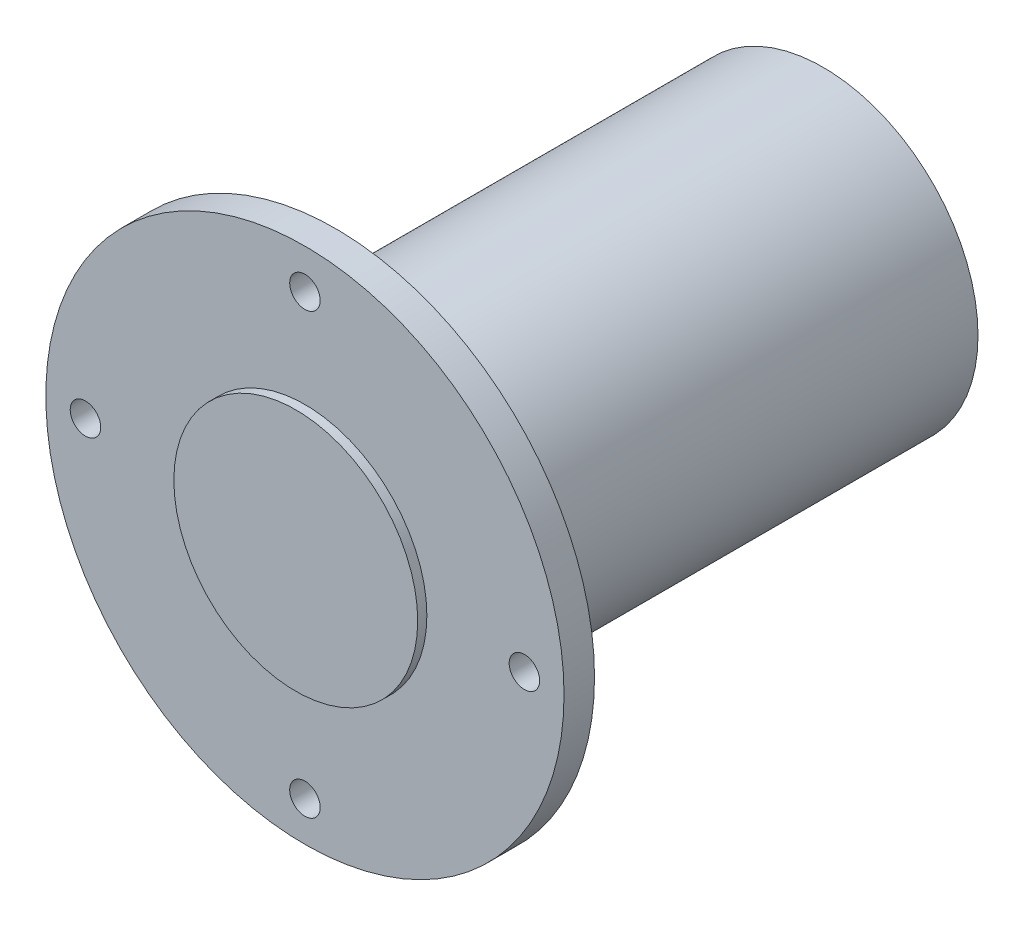
ISO-10303-21;
HEADER;
FILE_DESCRIPTION(('STEP AP214'),'2;1');
FILE_NAME('part.step','',(''),(''),'','','');
FILE_SCHEMA(('AUTOMOTIVE_DESIGN { 1 0 10303 214 1 1 1 1 }'));
ENDSEC;
DATA;
#1=APPLICATION_CONTEXT('core data for automotive mechanical design processes');
#2=APPLICATION_PROTOCOL_DEFINITION('international standard','automotive_design',2000,#1);
#3=PRODUCT_CONTEXT('',#1,'mechanical');
#4=PRODUCT('Part','Part','',(#3));
#5=PRODUCT_RELATED_PRODUCT_CATEGORY('part','',(#4));
#6=PRODUCT_DEFINITION_FORMATION('','',#4);
#7=PRODUCT_DEFINITION_CONTEXT('part definition',#1,'design');
#8=PRODUCT_DEFINITION('design','',#6,#7);
#9=PRODUCT_DEFINITION_SHAPE('','',#8);
#10=(LENGTH_UNIT() NAMED_UNIT(*) SI_UNIT(.MILLI.,.METRE.));
#11=(NAMED_UNIT(*) PLANE_ANGLE_UNIT() SI_UNIT($,.RADIAN.));
#12=(NAMED_UNIT(*) SI_UNIT($,.STERADIAN.) SOLID_ANGLE_UNIT());
#13=UNCERTAINTY_MEASURE_WITH_UNIT(LENGTH_MEASURE(1.E-05),#10,'distance_accuracy_value','');
#14=(GEOMETRIC_REPRESENTATION_CONTEXT(3) GLOBAL_UNCERTAINTY_ASSIGNED_CONTEXT((#13)) GLOBAL_UNIT_ASSIGNED_CONTEXT((#10,
#11,#12)) REPRESENTATION_CONTEXT('',''));
#15=CARTESIAN_POINT('',(0.,0.,0.));
#16=DIRECTION('',(0.,0.,1.));
#17=DIRECTION('',(1.,0.,0.));
#18=AXIS2_PLACEMENT_3D('',#15,#16,#17);
#19=CARTESIAN_POINT('',(0.,0.,0.));
#20=DIRECTION('',(0.,0.,1.));
#21=DIRECTION('',(1.,0.,0.));
#22=AXIS2_PLACEMENT_3D('',#19,#20,#21);
#23=PLANE('',#22);
#24=CARTESIAN_POINT('',(0.,36.,0.));
#25=DIRECTION('',(0.,0.,-1.));
#26=DIRECTION('',(-1.,0.,0.));
#27=AXIS2_PLACEMENT_3D('',#24,#25,#26);
#28=CIRCLE('',#27,2.49999999999999);
#29=CARTESIAN_POINT('',(-2.49999999999999,36.,0.));
#30=VERTEX_POINT('',#29);
#31=EDGE_CURVE('E105',#30,#30,#28,.T.);
#32=ORIENTED_EDGE('',*,*,#31,.F.);
#33=EDGE_LOOP('',(#32));
#34=FACE_BOUND('',#33,.T.);
#35=CARTESIAN_POINT('',(36.,0.,0.));
#36=DIRECTION('',(0.,0.,-1.));
#37=DIRECTION('',(-1.,0.,0.));
#38=AXIS2_PLACEMENT_3D('',#35,#36,#37);
#39=CIRCLE('',#38,2.49999999999999);
#40=CARTESIAN_POINT('',(33.5,0.,0.));
#41=VERTEX_POINT('',#40);
#42=EDGE_CURVE('E81',#41,#41,#39,.T.);
#43=ORIENTED_EDGE('',*,*,#42,.F.);
#44=EDGE_LOOP('',(#43));
#45=FACE_BOUND('',#44,.T.);
#46=CARTESIAN_POINT('',(0.,0.,0.));
#47=DIRECTION('',(0.,0.,1.));
#48=DIRECTION('',(1.,0.,0.));
#49=AXIS2_PLACEMENT_3D('',#46,#47,#48);
#50=CIRCLE('',#49,30.4);
#51=CARTESIAN_POINT('',(30.4,0.,0.));
#52=VERTEX_POINT('',#51);
#53=EDGE_CURVE('E10',#52,#52,#50,.T.);
#54=ORIENTED_EDGE('',*,*,#53,.T.);
#55=EDGE_LOOP('',(#54));
#56=FACE_BOUND('',#55,.T.);
#57=CARTESIAN_POINT('',(0.,0.,0.));
#58=DIRECTION('',(0.,0.,1.));
#59=DIRECTION('',(1.,0.,0.));
#60=AXIS2_PLACEMENT_3D('',#57,#58,#59);
#61=CIRCLE('',#60,42.5);
#62=CARTESIAN_POINT('',(42.5,0.,0.));
#63=VERTEX_POINT('',#62);
#64=EDGE_CURVE('E59',#63,#63,#61,.T.);
#65=ORIENTED_EDGE('',*,*,#64,.F.);
#66=EDGE_LOOP('',(#65));
#67=FACE_BOUND('',#66,.T.);
#68=CARTESIAN_POINT('',(0.,-36.,0.));
#69=DIRECTION('',(0.,0.,-1.));
#70=DIRECTION('',(-1.,0.,0.));
#71=AXIS2_PLACEMENT_3D('',#68,#69,#70);
#72=CIRCLE('',#71,2.49999999999999);
#73=CARTESIAN_POINT('',(-2.49999999999999,-36.,0.));
#74=VERTEX_POINT('',#73);
#75=EDGE_CURVE('E89',#74,#74,#72,.T.);
#76=ORIENTED_EDGE('',*,*,#75,.F.);
#77=EDGE_LOOP('',(#76));
#78=FACE_BOUND('',#77,.T.);
#79=CARTESIAN_POINT('',(-36.,0.,0.));
#80=DIRECTION('',(0.,0.,-1.));
#81=DIRECTION('',(-1.,0.,0.));
#82=AXIS2_PLACEMENT_3D('',#79,#80,#81);
#83=CIRCLE('',#82,2.49999999999999);
#84=CARTESIAN_POINT('',(-38.5,0.,0.));
#85=VERTEX_POINT('',#84);
#86=EDGE_CURVE('E97',#85,#85,#83,.T.);
#87=ORIENTED_EDGE('',*,*,#86,.F.);
#88=EDGE_LOOP('',(#87));
#89=FACE_BOUND('',#88,.T.);
#90=ADVANCED_FACE('F41',(#34,#45,#56,#67,#78,#89),#23,.F.);
#91=CARTESIAN_POINT('',(0.,0.,5.));
#92=DIRECTION('',(0.,0.,-1.));
#93=DIRECTION('',(-1.,0.,0.));
#94=AXIS2_PLACEMENT_3D('',#91,#92,#93);
#95=CYLINDRICAL_SURFACE('',#94,42.5);
#96=CARTESIAN_POINT('',(0.,0.,5.));
#97=DIRECTION('',(0.,0.,1.));
#98=DIRECTION('',(1.,0.,0.));
#99=AXIS2_PLACEMENT_3D('',#96,#97,#98);
#100=CIRCLE('',#99,42.5);
#101=CARTESIAN_POINT('',(42.5,0.,5.));
#102=VERTEX_POINT('',#101);
#103=EDGE_CURVE('E54',#102,#102,#100,.T.);
#104=ORIENTED_EDGE('',*,*,#103,.F.);
#105=EDGE_LOOP('',(#104));
#106=FACE_BOUND('',#105,.T.);
#107=ORIENTED_EDGE('',*,*,#64,.T.);
#108=EDGE_LOOP('',(#107));
#109=FACE_BOUND('',#108,.T.);
#110=ADVANCED_FACE('F131',(#106,#109),#95,.T.);
#111=CARTESIAN_POINT('',(0.,0.,5.));
#112=DIRECTION('',(0.,0.,1.));
#113=DIRECTION('',(1.,0.,0.));
#114=AXIS2_PLACEMENT_3D('',#111,#112,#113);
#115=PLANE('',#114);
#116=CARTESIAN_POINT('',(0.,0.,5.));
#117=DIRECTION('',(0.,0.,1.));
#118=DIRECTION('',(1.,0.,0.));
#119=AXIS2_PLACEMENT_3D('',#116,#117,#118);
#120=CIRCLE('',#119,20.);
#121=CARTESIAN_POINT('',(20.,0.,5.));
#122=VERTEX_POINT('',#121);
#123=EDGE_CURVE('E110',#122,#122,#120,.T.);
#124=ORIENTED_EDGE('',*,*,#123,.F.);
#125=EDGE_LOOP('',(#124));
#126=FACE_BOUND('',#125,.T.);
#127=CARTESIAN_POINT('',(0.,36.,5.));
#128=DIRECTION('',(0.,0.,1.));
#129=DIRECTION('',(1.,0.,0.));
#130=AXIS2_PLACEMENT_3D('',#127,#128,#129);
#131=CIRCLE('',#130,2.49999999999999);
#132=CARTESIAN_POINT('',(2.49999999999999,36.,5.));
#133=VERTEX_POINT('',#132);
#134=EDGE_CURVE('E101',#133,#133,#131,.T.);
#135=ORIENTED_EDGE('',*,*,#134,.F.);
#136=EDGE_LOOP('',(#135));
#137=FACE_BOUND('',#136,.T.);
#138=CARTESIAN_POINT('',(-36.,0.,5.));
#139=DIRECTION('',(0.,0.,1.));
#140=DIRECTION('',(1.,0.,0.));
#141=AXIS2_PLACEMENT_3D('',#138,#139,#140);
#142=CIRCLE('',#141,2.5);
#143=CARTESIAN_POINT('',(-33.5,0.,5.));
#144=VERTEX_POINT('',#143);
#145=EDGE_CURVE('E93',#144,#144,#142,.T.);
#146=ORIENTED_EDGE('',*,*,#145,.F.);
#147=EDGE_LOOP('',(#146));
#148=FACE_BOUND('',#147,.T.);
#149=CARTESIAN_POINT('',(0.,-36.,5.));
#150=DIRECTION('',(0.,0.,1.));
#151=DIRECTION('',(1.,0.,0.));
#152=AXIS2_PLACEMENT_3D('',#149,#150,#151);
#153=CIRCLE('',#152,2.49999999999999);
#154=CARTESIAN_POINT('',(2.49999999999999,-36.,5.));
#155=VERTEX_POINT('',#154);
#156=EDGE_CURVE('E85',#155,#155,#153,.T.);
#157=ORIENTED_EDGE('',*,*,#156,.F.);
#158=EDGE_LOOP('',(#157));
#159=FACE_BOUND('',#158,.T.);
#160=CARTESIAN_POINT('',(36.,0.,5.));
#161=DIRECTION('',(0.,0.,1.));
#162=DIRECTION('',(1.,0.,0.));
#163=AXIS2_PLACEMENT_3D('',#160,#161,#162);
#164=CIRCLE('',#163,2.5);
#165=CARTESIAN_POINT('',(38.5,0.,5.));
#166=VERTEX_POINT('',#165);
#167=EDGE_CURVE('E74',#166,#166,#164,.T.);
#168=ORIENTED_EDGE('',*,*,#167,.F.);
#169=EDGE_LOOP('',(#168));
#170=FACE_BOUND('',#169,.T.);
#171=ORIENTED_EDGE('',*,*,#103,.T.);
#172=EDGE_LOOP('',(#171));
#173=FACE_BOUND('',#172,.T.);
#174=ADVANCED_FACE('F127',(#126,#137,#148,#159,#170,#173),#115,.T.);
#175=CARTESIAN_POINT('',(0.,0.,-80.));
#176=DIRECTION('',(0.,0.,1.));
#177=DIRECTION('',(1.,0.,0.));
#178=AXIS2_PLACEMENT_3D('',#175,#176,#177);
#179=CYLINDRICAL_SURFACE('',#178,25.4);
#180=CARTESIAN_POINT('',(0.,0.,-5.));
#181=DIRECTION('',(0.,0.,1.));
#182=DIRECTION('',(1.,0.,0.));
#183=AXIS2_PLACEMENT_3D('',#180,#181,#182);
#184=CIRCLE('',#183,25.4);
#185=CARTESIAN_POINT('',(25.4,0.,-5.));
#186=VERTEX_POINT('',#185);
#187=EDGE_CURVE('E49',#186,#186,#184,.F.);
#188=ORIENTED_EDGE('',*,*,#187,.T.);
#189=EDGE_LOOP('',(#188));
#190=FACE_BOUND('',#189,.T.);
#191=CARTESIAN_POINT('',(0.,0.,-80.));
#192=DIRECTION('',(0.,0.,-1.));
#193=DIRECTION('',(-1.,0.,0.));
#194=AXIS2_PLACEMENT_3D('',#191,#192,#193);
#195=CIRCLE('',#194,25.4);
#196=CARTESIAN_POINT('',(-25.4,0.,-80.));
#197=VERTEX_POINT('',#196);
#198=EDGE_CURVE('E64',#197,#197,#195,.T.);
#199=ORIENTED_EDGE('',*,*,#198,.F.);
#200=EDGE_LOOP('',(#199));
#201=FACE_BOUND('',#200,.T.);
#202=ADVANCED_FACE('F130',(#190,#201),#179,.T.);
#203=CARTESIAN_POINT('',(0.,0.,-80.));
#204=DIRECTION('',(0.,0.,-1.));
#205=DIRECTION('',(-1.,0.,0.));
#206=AXIS2_PLACEMENT_3D('',#203,#204,#205);
#207=PLANE('',#206);
#208=CARTESIAN_POINT('',(0.,0.,-80.));
#209=DIRECTION('',(0.,0.,-1.));
#210=DIRECTION('',(-1.,0.,0.));
#211=AXIS2_PLACEMENT_3D('',#208,#209,#210);
#212=CIRCLE('',#211,20.4);
#213=CARTESIAN_POINT('',(-20.4,0.,-80.));
#214=VERTEX_POINT('',#213);
#215=EDGE_CURVE('E70',#214,#214,#212,.T.);
#216=ORIENTED_EDGE('',*,*,#215,.F.);
#217=EDGE_LOOP('',(#216));
#218=FACE_BOUND('',#217,.T.);
#219=ORIENTED_EDGE('',*,*,#198,.T.);
#220=EDGE_LOOP('',(#219));
#221=FACE_BOUND('',#220,.T.);
#222=ADVANCED_FACE('F180',(#218,#221),#207,.T.);
#223=CARTESIAN_POINT('',(0.,0.,-9.99999999999999));
#224=DIRECTION('',(0.,0.,-1.));
#225=DIRECTION('',(-1.,0.,0.));
#226=AXIS2_PLACEMENT_3D('',#223,#224,#225);
#227=CYLINDRICAL_SURFACE('',#226,20.4);
#228=CARTESIAN_POINT('',(0.,0.,-9.99999999999999));
#229=DIRECTION('',(0.,0.,-1.));
#230=DIRECTION('',(-1.,0.,0.));
#231=AXIS2_PLACEMENT_3D('',#228,#229,#230);
#232=CIRCLE('',#231,20.4);
#233=CARTESIAN_POINT('',(-20.4,0.,-9.99999999999999));
#234=VERTEX_POINT('',#233);
#235=EDGE_CURVE('E69',#234,#234,#232,.T.);
#236=ORIENTED_EDGE('',*,*,#235,.F.);
#237=EDGE_LOOP('',(#236));
#238=FACE_BOUND('',#237,.T.);
#239=ORIENTED_EDGE('',*,*,#215,.T.);
#240=EDGE_LOOP('',(#239));
#241=FACE_BOUND('',#240,.T.);
#242=ADVANCED_FACE('F176',(#238,#241),#227,.F.);
#243=CARTESIAN_POINT('',(0.,0.,-9.99999999999999));
#244=DIRECTION('',(0.,0.,-1.));
#245=DIRECTION('',(-1.,0.,0.));
#246=AXIS2_PLACEMENT_3D('',#243,#244,#245);
#247=PLANE('',#246);
#248=ORIENTED_EDGE('',*,*,#235,.T.);
#249=EDGE_LOOP('',(#248));
#250=FACE_BOUND('',#249,.T.);
#251=ADVANCED_FACE('F173',(#250),#247,.T.);
#252=CARTESIAN_POINT('',(0.,0.,-5.));
#253=DIRECTION('',(0.,0.,1.));
#254=DIRECTION('',(1.,0.,0.));
#255=AXIS2_PLACEMENT_3D('',#252,#253,#254);
#256=TOROIDAL_SURFACE('',#255,30.4,5.);
#257=ORIENTED_EDGE('',*,*,#53,.F.);
#258=EDGE_LOOP('',(#257));
#259=FACE_BOUND('',#258,.T.);
#260=ORIENTED_EDGE('',*,*,#187,.F.);
#261=EDGE_LOOP('',(#260));
#262=FACE_BOUND('',#261,.T.);
#263=ADVANCED_FACE('F43',(#259,#262),#256,.F.);
#264=CARTESIAN_POINT('',(36.,0.,0.));
#265=DIRECTION('',(0.,0.,-1.));
#266=DIRECTION('',(-1.,0.,0.));
#267=AXIS2_PLACEMENT_3D('',#264,#265,#266);
#268=CYLINDRICAL_SURFACE('',#267,2.5);
#269=ORIENTED_EDGE('',*,*,#42,.T.);
#270=EDGE_LOOP('',(#269));
#271=FACE_BOUND('',#270,.T.);
#272=ORIENTED_EDGE('',*,*,#167,.T.);
#273=EDGE_LOOP('',(#272));
#274=FACE_BOUND('',#273,.T.);
#275=ADVANCED_FACE('F166',(#271,#274),#268,.F.);
#276=CARTESIAN_POINT('',(0.,-36.,0.));
#277=DIRECTION('',(0.,0.,-1.));
#278=DIRECTION('',(-1.,0.,0.));
#279=AXIS2_PLACEMENT_3D('',#276,#277,#278);
#280=CYLINDRICAL_SURFACE('',#279,2.49999999999999);
#281=ORIENTED_EDGE('',*,*,#75,.T.);
#282=EDGE_LOOP('',(#281));
#283=FACE_BOUND('',#282,.T.);
#284=ORIENTED_EDGE('',*,*,#156,.T.);
#285=EDGE_LOOP('',(#284));
#286=FACE_BOUND('',#285,.T.);
#287=ADVANCED_FACE('F158',(#283,#286),#280,.F.);
#288=CARTESIAN_POINT('',(-36.,0.,0.));
#289=DIRECTION('',(0.,0.,-1.));
#290=DIRECTION('',(-1.,0.,0.));
#291=AXIS2_PLACEMENT_3D('',#288,#289,#290);
#292=CYLINDRICAL_SURFACE('',#291,2.5);
#293=ORIENTED_EDGE('',*,*,#86,.T.);
#294=EDGE_LOOP('',(#293));
#295=FACE_BOUND('',#294,.T.);
#296=ORIENTED_EDGE('',*,*,#145,.T.);
#297=EDGE_LOOP('',(#296));
#298=FACE_BOUND('',#297,.T.);
#299=ADVANCED_FACE('F155',(#295,#298),#292,.F.);
#300=CARTESIAN_POINT('',(0.,36.,0.));
#301=DIRECTION('',(0.,0.,-1.));
#302=DIRECTION('',(-1.,0.,0.));
#303=AXIS2_PLACEMENT_3D('',#300,#301,#302);
#304=CYLINDRICAL_SURFACE('',#303,2.49999999999999);
#305=ORIENTED_EDGE('',*,*,#31,.T.);
#306=EDGE_LOOP('',(#305));
#307=FACE_BOUND('',#306,.T.);
#308=ORIENTED_EDGE('',*,*,#134,.T.);
#309=EDGE_LOOP('',(#308));
#310=FACE_BOUND('',#309,.T.);
#311=ADVANCED_FACE('F123',(#307,#310),#304,.F.);
#312=CARTESIAN_POINT('',(0.,0.,6.5));
#313=DIRECTION('',(0.,0.,-1.));
#314=DIRECTION('',(-1.,0.,0.));
#315=AXIS2_PLACEMENT_3D('',#312,#313,#314);
#316=CYLINDRICAL_SURFACE('',#315,20.);
#317=CARTESIAN_POINT('',(0.,0.,6.5));
#318=DIRECTION('',(0.,0.,1.));
#319=DIRECTION('',(1.,0.,0.));
#320=AXIS2_PLACEMENT_3D('',#317,#318,#319);
#321=CIRCLE('',#320,20.);
#322=CARTESIAN_POINT('',(20.,0.,6.5));
#323=VERTEX_POINT('',#322);
#324=EDGE_CURVE('E109',#323,#323,#321,.T.);
#325=ORIENTED_EDGE('',*,*,#324,.F.);
#326=EDGE_LOOP('',(#325));
#327=FACE_BOUND('',#326,.T.);
#328=ORIENTED_EDGE('',*,*,#123,.T.);
#329=EDGE_LOOP('',(#328));
#330=FACE_BOUND('',#329,.T.);
#331=ADVANCED_FACE('F120',(#327,#330),#316,.T.);
#332=CARTESIAN_POINT('',(0.,0.,6.5));
#333=DIRECTION('',(0.,0.,1.));
#334=DIRECTION('',(1.,0.,0.));
#335=AXIS2_PLACEMENT_3D('',#332,#333,#334);
#336=PLANE('',#335);
#337=ORIENTED_EDGE('',*,*,#324,.T.);
#338=EDGE_LOOP('',(#337));
#339=FACE_BOUND('',#338,.T.);
#340=ADVANCED_FACE('F118',(#339),#336,.T.);
#341=CLOSED_SHELL('',(#90,#110,#174,#202,#222,#242,#251,#263,#275,#287,#299,#311,#331,#340));
#342=MANIFOLD_SOLID_BREP('B2',#341);
#343=ADVANCED_BREP_SHAPE_REPRESENTATION('',(#18,#342),#14);
#344=SHAPE_DEFINITION_REPRESENTATION(#9,#343);
ENDSEC;
END-ISO-10303-21;
